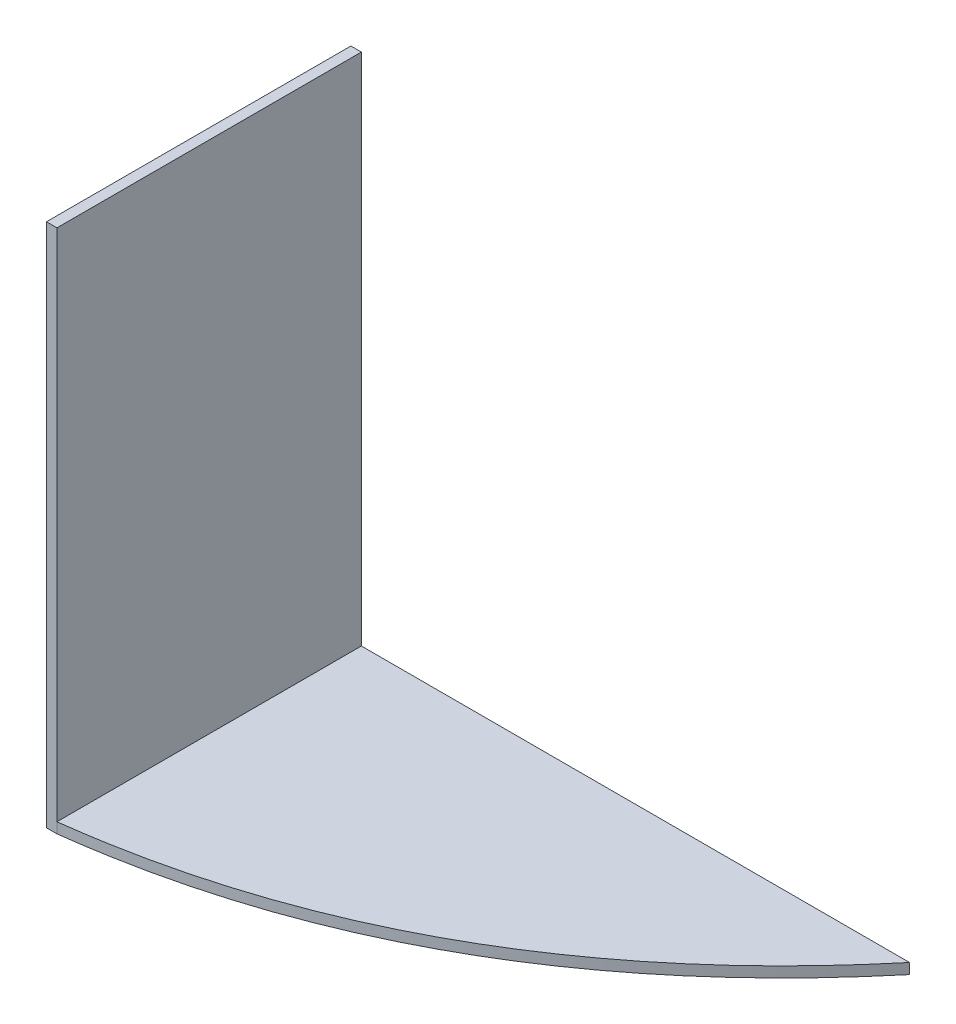
ISO-10303-21;
HEADER;
FILE_DESCRIPTION(('STEP AP214'),'2;1');
FILE_NAME('part.step','',(''),(''),'','','');
FILE_SCHEMA(('AUTOMOTIVE_DESIGN { 1 0 10303 214 1 1 1 1 }'));
ENDSEC;
DATA;
#1=APPLICATION_CONTEXT('core data for automotive mechanical design processes');
#2=APPLICATION_PROTOCOL_DEFINITION('international standard','automotive_design',2000,#1);
#3=PRODUCT_CONTEXT('',#1,'mechanical');
#4=PRODUCT('Part','Part','',(#3));
#5=PRODUCT_RELATED_PRODUCT_CATEGORY('part','',(#4));
#6=PRODUCT_DEFINITION_FORMATION('','',#4);
#7=PRODUCT_DEFINITION_CONTEXT('part definition',#1,'design');
#8=PRODUCT_DEFINITION('design','',#6,#7);
#9=PRODUCT_DEFINITION_SHAPE('','',#8);
#10=(LENGTH_UNIT() NAMED_UNIT(*) SI_UNIT(.MILLI.,.METRE.));
#11=(NAMED_UNIT(*) PLANE_ANGLE_UNIT() SI_UNIT($,.RADIAN.));
#12=(NAMED_UNIT(*) SI_UNIT($,.STERADIAN.) SOLID_ANGLE_UNIT());
#13=UNCERTAINTY_MEASURE_WITH_UNIT(LENGTH_MEASURE(1.E-05),#10,'distance_accuracy_value','');
#14=(GEOMETRIC_REPRESENTATION_CONTEXT(3) GLOBAL_UNCERTAINTY_ASSIGNED_CONTEXT((#13)) GLOBAL_UNIT_ASSIGNED_CONTEXT((#10,
#11,#12)) REPRESENTATION_CONTEXT('',''));
#15=CARTESIAN_POINT('',(0.,0.,0.));
#16=DIRECTION('',(0.,0.,1.));
#17=DIRECTION('',(1.,0.,0.));
#18=AXIS2_PLACEMENT_3D('',#15,#16,#17);
#19=CARTESIAN_POINT('',(0.915662650602404,23.3734939759036,58.));
#20=DIRECTION('',(-1.,0.,0.));
#21=DIRECTION('',(0.,-1.,0.));
#22=AXIS2_PLACEMENT_3D('',#19,#20,#21);
#23=PLANE('',#22);
#24=DIRECTION('',(0.,0.,1.));
#25=VECTOR('',#24,1.);
#26=CARTESIAN_POINT('',(0.915662650602415,-74.6265060240964,58.));
#27=LINE('',#26,#25);
#28=CARTESIAN_POINT('',(0.915662650602416,-74.6265060240964,0.));
#29=VERTEX_POINT('',#28);
#30=CARTESIAN_POINT('',(0.915662650602415,-74.6265060240964,58.));
#31=VERTEX_POINT('',#30);
#32=EDGE_CURVE('E43',#29,#31,#27,.T.);
#33=ORIENTED_EDGE('',*,*,#32,.F.);
#34=DIRECTION('',(0.,1.,0.));
#35=VECTOR('',#34,1.);
#36=CARTESIAN_POINT('',(0.915662650602404,23.3734939759036,0.));
#37=LINE('',#36,#35);
#38=CARTESIAN_POINT('',(0.915662650602404,23.3734939759036,0.));
#39=VERTEX_POINT('',#38);
#40=EDGE_CURVE('E108',#29,#39,#37,.T.);
#41=ORIENTED_EDGE('',*,*,#40,.T.);
#42=DIRECTION('',(0.,0.,-1.));
#43=VECTOR('',#42,1.);
#44=CARTESIAN_POINT('',(0.915662650602404,23.3734939759036,58.));
#45=LINE('',#44,#43);
#46=CARTESIAN_POINT('',(0.915662650602404,23.3734939759036,58.));
#47=VERTEX_POINT('',#46);
#48=EDGE_CURVE('E50',#47,#39,#45,.T.);
#49=ORIENTED_EDGE('',*,*,#48,.F.);
#50=DIRECTION('',(0.,1.,0.));
#51=VECTOR('',#50,1.);
#52=CARTESIAN_POINT('',(0.915662650602404,23.3734939759036,58.));
#53=LINE('',#52,#51);
#54=EDGE_CURVE('E174',#31,#47,#53,.T.);
#55=ORIENTED_EDGE('',*,*,#54,.F.);
#56=EDGE_LOOP('',(#33,#41,#49,#55));
#57=FACE_BOUND('',#56,.T.);
#58=ADVANCED_FACE('F39',(#57),#23,.F.);
#59=CARTESIAN_POINT('',(-1.0843373493976,23.3734939759036,58.));
#60=DIRECTION('',(1.,0.,0.));
#61=DIRECTION('',(0.,1.,0.));
#62=AXIS2_PLACEMENT_3D('',#59,#60,#61);
#63=PLANE('',#62);
#64=DIRECTION('',(0.,0.,-1.));
#65=VECTOR('',#64,1.);
#66=CARTESIAN_POINT('',(-1.08433734939758,-76.6265060240964,58.));
#67=LINE('',#66,#65);
#68=CARTESIAN_POINT('',(-1.08433734939758,-76.6265060240964,58.));
#69=VERTEX_POINT('',#68);
#70=CARTESIAN_POINT('',(-1.08433734939758,-76.6265060240964,0.));
#71=VERTEX_POINT('',#70);
#72=EDGE_CURVE('E11',#69,#71,#67,.T.);
#73=ORIENTED_EDGE('',*,*,#72,.F.);
#74=DIRECTION('',(0.,-1.,0.));
#75=VECTOR('',#74,1.);
#76=CARTESIAN_POINT('',(-1.0843373493976,23.3734939759036,58.));
#77=LINE('',#76,#75);
#78=CARTESIAN_POINT('',(-1.0843373493976,23.3734939759036,58.));
#79=VERTEX_POINT('',#78);
#80=EDGE_CURVE('E88',#79,#69,#77,.T.);
#81=ORIENTED_EDGE('',*,*,#80,.F.);
#82=DIRECTION('',(0.,0.,-1.));
#83=VECTOR('',#82,1.);
#84=CARTESIAN_POINT('',(-1.0843373493976,23.3734939759036,58.));
#85=LINE('',#84,#83);
#86=CARTESIAN_POINT('',(-1.0843373493976,23.3734939759036,0.));
#87=VERTEX_POINT('',#86);
#88=EDGE_CURVE('E170',#79,#87,#85,.T.);
#89=ORIENTED_EDGE('',*,*,#88,.T.);
#90=DIRECTION('',(0.,-1.,0.));
#91=VECTOR('',#90,1.);
#92=CARTESIAN_POINT('',(-1.0843373493976,23.3734939759036,0.));
#93=LINE('',#92,#91);
#94=EDGE_CURVE('E160',#87,#71,#93,.T.);
#95=ORIENTED_EDGE('',*,*,#94,.T.);
#96=EDGE_LOOP('',(#73,#81,#89,#95));
#97=FACE_BOUND('',#96,.T.);
#98=ADVANCED_FACE('F41',(#97),#63,.F.);
#99=CARTESIAN_POINT('',(-1.08433734939758,-76.6265060240964,58.));
#100=DIRECTION('',(0.,1.,0.));
#101=DIRECTION('',(0.,0.,1.));
#102=AXIS2_PLACEMENT_3D('',#99,#100,#101);
#103=PLANE('',#102);
#104=DIRECTION('',(1.,0.,0.));
#105=VECTOR('',#104,1.);
#106=CARTESIAN_POINT('',(-1.08433734939758,-76.6265060240964,0.));
#107=LINE('',#106,#105);
#108=CARTESIAN_POINT('',(105.357714941192,-76.6265060240962,0.));
#109=VERTEX_POINT('',#108);
#110=EDGE_CURVE('E156',#71,#109,#107,.T.);
#111=ORIENTED_EDGE('',*,*,#110,.T.);
#112=CARTESIAN_POINT('',(105.357714941192,-76.6265060240962,0.));
#113=CARTESIAN_POINT('',(63.6174049248609,-76.6265060240963,50.1879247033215));
#114=CARTESIAN_POINT('',(0.915662650602416,-76.6265060240964,58.));
#115=B_SPLINE_CURVE_WITH_KNOTS('',2,(#112,#113,#114),.UNSPECIFIED.,.F.,.F.,(3,3),(0.,1.),.UNSPECIFIED.);
#116=CARTESIAN_POINT('',(0.915662650602416,-76.6265060240964,58.));
#117=VERTEX_POINT('',#116);
#118=EDGE_CURVE('E115',#109,#117,#115,.T.);
#119=ORIENTED_EDGE('',*,*,#118,.T.);
#120=DIRECTION('',(1.,0.,0.));
#121=VECTOR('',#120,1.);
#122=CARTESIAN_POINT('',(-1.08433734939758,-76.6265060240964,58.));
#123=LINE('',#122,#121);
#124=EDGE_CURVE('E176',#69,#117,#123,.T.);
#125=ORIENTED_EDGE('',*,*,#124,.F.);
#126=ORIENTED_EDGE('',*,*,#72,.T.);
#127=EDGE_LOOP('',(#111,#119,#125,#126));
#128=FACE_BOUND('',#127,.T.);
#129=ADVANCED_FACE('F147',(#128),#103,.F.);
#130=CARTESIAN_POINT('',(-1.0843373493976,23.3734939759036,58.));
#131=DIRECTION('',(0.,-1.,0.));
#132=DIRECTION('',(0.,0.,-1.));
#133=AXIS2_PLACEMENT_3D('',#130,#131,#132);
#134=PLANE('',#133);
#135=DIRECTION('',(-1.,0.,0.));
#136=VECTOR('',#135,1.);
#137=CARTESIAN_POINT('',(-1.0843373493976,23.3734939759036,0.));
#138=LINE('',#137,#136);
#139=EDGE_CURVE('E84',#39,#87,#138,.T.);
#140=ORIENTED_EDGE('',*,*,#139,.T.);
#141=ORIENTED_EDGE('',*,*,#88,.F.);
#142=DIRECTION('',(-1.,0.,0.));
#143=VECTOR('',#142,1.);
#144=CARTESIAN_POINT('',(-1.0843373493976,23.3734939759036,58.));
#145=LINE('',#144,#143);
#146=EDGE_CURVE('E67',#47,#79,#145,.T.);
#147=ORIENTED_EDGE('',*,*,#146,.F.);
#148=ORIENTED_EDGE('',*,*,#48,.T.);
#149=EDGE_LOOP('',(#140,#141,#147,#148));
#150=FACE_BOUND('',#149,.T.);
#151=ADVANCED_FACE('F142',(#150),#134,.F.);
#152=CARTESIAN_POINT('',(0.,0.,58.));
#153=DIRECTION('',(0.,0.,1.));
#154=DIRECTION('',(1.,0.,0.));
#155=AXIS2_PLACEMENT_3D('',#152,#153,#154);
#156=PLANE('',#155);
#157=EDGE_CURVE('E125',#117,#31,#53,.T.);
#158=ORIENTED_EDGE('',*,*,#157,.T.);
#159=ORIENTED_EDGE('',*,*,#54,.T.);
#160=ORIENTED_EDGE('',*,*,#146,.T.);
#161=ORIENTED_EDGE('',*,*,#80,.T.);
#162=ORIENTED_EDGE('',*,*,#124,.T.);
#163=EDGE_LOOP('',(#158,#159,#160,#161,#162));
#164=FACE_BOUND('',#163,.T.);
#165=ADVANCED_FACE('F139',(#164),#156,.T.);
#166=CARTESIAN_POINT('',(0.,0.,0.));
#167=DIRECTION('',(0.,0.,1.));
#168=DIRECTION('',(1.,0.,0.));
#169=AXIS2_PLACEMENT_3D('',#166,#167,#168);
#170=PLANE('',#169);
#171=ORIENTED_EDGE('',*,*,#110,.F.);
#172=ORIENTED_EDGE('',*,*,#94,.F.);
#173=ORIENTED_EDGE('',*,*,#139,.F.);
#174=ORIENTED_EDGE('',*,*,#40,.F.);
#175=DIRECTION('',(1.,0.,0.));
#176=VECTOR('',#175,1.);
#177=CARTESIAN_POINT('',(-1.08433734939761,-74.6265060240964,0.));
#178=LINE('',#177,#176);
#179=CARTESIAN_POINT('',(105.357714941192,-74.6265060240962,0.));
#180=VERTEX_POINT('',#179);
#181=EDGE_CURVE('E103',#29,#180,#178,.T.);
#182=ORIENTED_EDGE('',*,*,#181,.T.);
#183=DIRECTION('',(0.,-1.,0.));
#184=VECTOR('',#183,1.);
#185=CARTESIAN_POINT('',(105.357714941192,-74.6265060240962,0.));
#186=LINE('',#185,#184);
#187=EDGE_CURVE('E106',#180,#109,#186,.T.);
#188=ORIENTED_EDGE('',*,*,#187,.T.);
#189=EDGE_LOOP('',(#171,#172,#173,#174,#182,#188));
#190=FACE_BOUND('',#189,.T.);
#191=ADVANCED_FACE('F105',(#190),#170,.F.);
#192=CARTESIAN_POINT('',(58.3770468603791,-74.6265060240963,39.5939623516608));
#193=DIRECTION('',(0.,-1.,0.));
#194=DIRECTION('',(1.,0.,0.));
#195=AXIS2_PLACEMENT_3D('',#192,#193,#194);
#196=PLANE('',#195);
#197=ORIENTED_EDGE('',*,*,#181,.F.);
#198=ORIENTED_EDGE('',*,*,#32,.T.);
#199=CARTESIAN_POINT('',(105.357714941192,-74.6265060240962,0.));
#200=CARTESIAN_POINT('',(63.6174049248609,-74.6265060240963,50.1879247033215));
#201=CARTESIAN_POINT('',(0.915662650602412,-74.6265060240964,58.));
#202=B_SPLINE_CURVE_WITH_KNOTS('',2,(#199,#200,#201),.UNSPECIFIED.,.F.,.F.,(3,3),(0.,1.),.UNSPECIFIED.);
#203=EDGE_CURVE('E58',#180,#31,#202,.T.);
#204=ORIENTED_EDGE('',*,*,#203,.F.);
#205=EDGE_LOOP('',(#197,#198,#204));
#206=FACE_BOUND('',#205,.T.);
#207=ADVANCED_FACE('F118',(#206),#196,.F.);
#208=DIRECTION('',(0.,-1.,0.));
#209=VECTOR('',#208,1.);
#210=SURFACE_OF_LINEAR_EXTRUSION('',#202,#209);
#211=ORIENTED_EDGE('',*,*,#118,.F.);
#212=ORIENTED_EDGE('',*,*,#187,.F.);
#213=ORIENTED_EDGE('',*,*,#203,.T.);
#214=ORIENTED_EDGE('',*,*,#157,.F.);
#215=EDGE_LOOP('',(#211,#212,#213,#214));
#216=FACE_BOUND('',#215,.T.);
#217=ADVANCED_FACE('F113',(#216),#210,.T.);
#218=CLOSED_SHELL('',(#58,#98,#129,#151,#165,#191,#207,#217));
#219=MANIFOLD_SOLID_BREP('B2',#218);
#220=ADVANCED_BREP_SHAPE_REPRESENTATION('',(#18,#219),#14);
#221=SHAPE_DEFINITION_REPRESENTATION(#9,#220);
ENDSEC;
END-ISO-10303-21;
